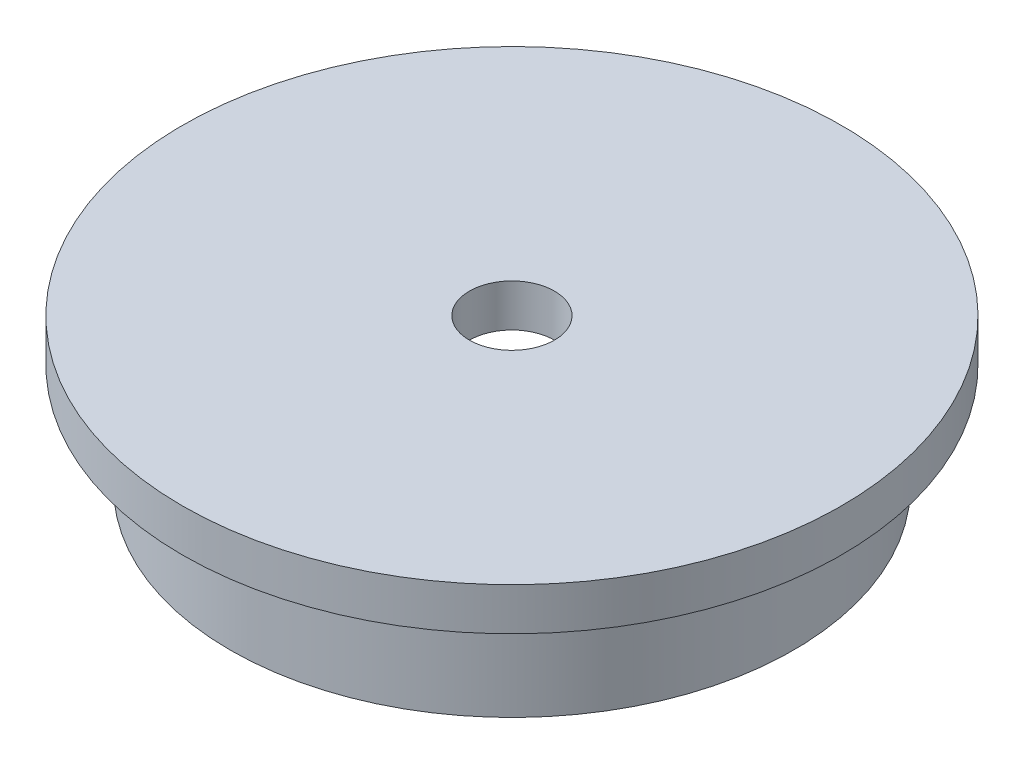
ISO-10303-21;
HEADER;
FILE_DESCRIPTION(('STEP AP214'),'2;1');
FILE_NAME('part.step','',(''),(''),'','','');
FILE_SCHEMA(('AUTOMOTIVE_DESIGN { 1 0 10303 214 1 1 1 1 }'));
ENDSEC;
DATA;
#1=APPLICATION_CONTEXT('core data for automotive mechanical design processes');
#2=APPLICATION_PROTOCOL_DEFINITION('international standard','automotive_design',2000,#1);
#3=PRODUCT_CONTEXT('',#1,'mechanical');
#4=PRODUCT('Part','Part','',(#3));
#5=PRODUCT_RELATED_PRODUCT_CATEGORY('part','',(#4));
#6=PRODUCT_DEFINITION_FORMATION('','',#4);
#7=PRODUCT_DEFINITION_CONTEXT('part definition',#1,'design');
#8=PRODUCT_DEFINITION('design','',#6,#7);
#9=PRODUCT_DEFINITION_SHAPE('','',#8);
#10=(LENGTH_UNIT() NAMED_UNIT(*) SI_UNIT(.MILLI.,.METRE.));
#11=(NAMED_UNIT(*) PLANE_ANGLE_UNIT() SI_UNIT($,.RADIAN.));
#12=(NAMED_UNIT(*) SI_UNIT($,.STERADIAN.) SOLID_ANGLE_UNIT());
#13=UNCERTAINTY_MEASURE_WITH_UNIT(LENGTH_MEASURE(1.E-05),#10,'distance_accuracy_value','');
#14=(GEOMETRIC_REPRESENTATION_CONTEXT(3) GLOBAL_UNCERTAINTY_ASSIGNED_CONTEXT((#13)) GLOBAL_UNIT_ASSIGNED_CONTEXT((#10,
#11,#12)) REPRESENTATION_CONTEXT('',''));
#15=CARTESIAN_POINT('',(0.,0.,0.));
#16=DIRECTION('',(0.,0.,1.));
#17=DIRECTION('',(1.,0.,0.));
#18=AXIS2_PLACEMENT_3D('',#15,#16,#17);
#19=CARTESIAN_POINT('',(0.,0.,0.));
#20=DIRECTION('',(0.,1.,0.));
#21=DIRECTION('',(0.,0.,1.));
#22=AXIS2_PLACEMENT_3D('',#19,#20,#21);
#23=PLANE('',#22);
#24=CARTESIAN_POINT('',(0.,0.,0.));
#25=DIRECTION('',(0.,1.,0.));
#26=DIRECTION('',(0.,0.,1.));
#27=AXIS2_PLACEMENT_3D('',#24,#25,#26);
#28=CIRCLE('',#27,33.655);
#29=CARTESIAN_POINT('',(0.,0.,33.655));
#30=VERTEX_POINT('',#29);
#31=EDGE_CURVE('E43',#30,#30,#28,.T.);
#32=ORIENTED_EDGE('',*,*,#31,.F.);
#33=EDGE_LOOP('',(#32));
#34=FACE_BOUND('',#33,.T.);
#35=CARTESIAN_POINT('',(0.,0.,0.));
#36=DIRECTION('',(0.,1.,0.));
#37=DIRECTION('',(0.,0.,1.));
#38=AXIS2_PLACEMENT_3D('',#35,#36,#37);
#39=CIRCLE('',#38,28.575);
#40=CARTESIAN_POINT('',(0.,0.,28.575));
#41=VERTEX_POINT('',#40);
#42=EDGE_CURVE('E48',#41,#41,#39,.T.);
#43=ORIENTED_EDGE('',*,*,#42,.T.);
#44=EDGE_LOOP('',(#43));
#45=FACE_BOUND('',#44,.T.);
#46=ADVANCED_FACE('F35',(#34,#45),#23,.F.);
#47=CARTESIAN_POINT('',(0.,12.7,0.));
#48=DIRECTION('',(0.,-1.,0.));
#49=DIRECTION('',(0.,0.,-1.));
#50=AXIS2_PLACEMENT_3D('',#47,#48,#49);
#51=CYLINDRICAL_SURFACE('',#50,33.655);
#52=CARTESIAN_POINT('',(0.,12.7,0.));
#53=DIRECTION('',(0.,1.,0.));
#54=DIRECTION('',(0.,0.,1.));
#55=AXIS2_PLACEMENT_3D('',#52,#53,#54);
#56=CIRCLE('',#55,33.655);
#57=CARTESIAN_POINT('',(0.,12.7,33.655));
#58=VERTEX_POINT('',#57);
#59=EDGE_CURVE('E10',#58,#58,#56,.T.);
#60=ORIENTED_EDGE('',*,*,#59,.F.);
#61=EDGE_LOOP('',(#60));
#62=FACE_BOUND('',#61,.T.);
#63=ORIENTED_EDGE('',*,*,#31,.T.);
#64=EDGE_LOOP('',(#63));
#65=FACE_BOUND('',#64,.T.);
#66=ADVANCED_FACE('F37',(#62,#65),#51,.T.);
#67=CARTESIAN_POINT('',(0.,12.7,0.));
#68=DIRECTION('',(0.,-1.,0.));
#69=DIRECTION('',(0.,0.,-1.));
#70=AXIS2_PLACEMENT_3D('',#67,#68,#69);
#71=CYLINDRICAL_SURFACE('',#70,28.575);
#72=CARTESIAN_POINT('',(0.,12.7,0.));
#73=DIRECTION('',(0.,1.,0.));
#74=DIRECTION('',(0.,0.,1.));
#75=AXIS2_PLACEMENT_3D('',#72,#73,#74);
#76=CIRCLE('',#75,28.575);
#77=CARTESIAN_POINT('',(0.,12.7,28.575));
#78=VERTEX_POINT('',#77);
#79=EDGE_CURVE('E52',#78,#78,#76,.T.);
#80=ORIENTED_EDGE('',*,*,#79,.T.);
#81=EDGE_LOOP('',(#80));
#82=FACE_BOUND('',#81,.T.);
#83=ORIENTED_EDGE('',*,*,#42,.F.);
#84=EDGE_LOOP('',(#83));
#85=FACE_BOUND('',#84,.T.);
#86=ADVANCED_FACE('F92',(#82,#85),#71,.F.);
#87=CARTESIAN_POINT('',(0.,12.7,0.));
#88=DIRECTION('',(0.,1.,0.));
#89=DIRECTION('',(0.,0.,1.));
#90=AXIS2_PLACEMENT_3D('',#87,#88,#89);
#91=PLANE('',#90);
#92=CARTESIAN_POINT('',(0.,12.7,0.));
#93=DIRECTION('',(0.,1.,0.));
#94=DIRECTION('',(0.,0.,1.));
#95=AXIS2_PLACEMENT_3D('',#92,#93,#94);
#96=CIRCLE('',#95,5.08);
#97=CARTESIAN_POINT('',(0.,12.7,5.08));
#98=VERTEX_POINT('',#97);
#99=EDGE_CURVE('E59',#98,#98,#96,.T.);
#100=ORIENTED_EDGE('',*,*,#99,.T.);
#101=EDGE_LOOP('',(#100));
#102=FACE_BOUND('',#101,.T.);
#103=ORIENTED_EDGE('',*,*,#79,.F.);
#104=EDGE_LOOP('',(#103));
#105=FACE_BOUND('',#104,.T.);
#106=ADVANCED_FACE('F81',(#102,#105),#91,.F.);
#107=CARTESIAN_POINT('',(0.,17.78,0.));
#108=DIRECTION('',(0.,-1.,0.));
#109=DIRECTION('',(0.,0.,-1.));
#110=AXIS2_PLACEMENT_3D('',#107,#108,#109);
#111=CYLINDRICAL_SURFACE('',#110,39.37);
#112=CARTESIAN_POINT('',(0.,17.78,0.));
#113=DIRECTION('',(0.,1.,0.));
#114=DIRECTION('',(0.,0.,1.));
#115=AXIS2_PLACEMENT_3D('',#112,#113,#114);
#116=CIRCLE('',#115,39.37);
#117=CARTESIAN_POINT('',(0.,17.78,39.37));
#118=VERTEX_POINT('',#117);
#119=EDGE_CURVE('E55',#118,#118,#116,.T.);
#120=ORIENTED_EDGE('',*,*,#119,.F.);
#121=EDGE_LOOP('',(#120));
#122=FACE_BOUND('',#121,.T.);
#123=CARTESIAN_POINT('',(0.,12.7,0.));
#124=DIRECTION('',(0.,1.,0.));
#125=DIRECTION('',(0.,0.,1.));
#126=AXIS2_PLACEMENT_3D('',#123,#124,#125);
#127=CIRCLE('',#126,39.37);
#128=CARTESIAN_POINT('',(0.,12.7,39.37));
#129=VERTEX_POINT('',#128);
#130=EDGE_CURVE('E56',#129,#129,#127,.T.);
#131=ORIENTED_EDGE('',*,*,#130,.T.);
#132=EDGE_LOOP('',(#131));
#133=FACE_BOUND('',#132,.T.);
#134=ADVANCED_FACE('F75',(#122,#133),#111,.T.);
#135=CARTESIAN_POINT('',(0.,17.78,0.));
#136=DIRECTION('',(0.,1.,0.));
#137=DIRECTION('',(0.,0.,1.));
#138=AXIS2_PLACEMENT_3D('',#135,#136,#137);
#139=PLANE('',#138);
#140=CARTESIAN_POINT('',(0.,17.78,0.));
#141=DIRECTION('',(0.,1.,0.));
#142=DIRECTION('',(0.,0.,1.));
#143=AXIS2_PLACEMENT_3D('',#140,#141,#142);
#144=CIRCLE('',#143,5.08);
#145=CARTESIAN_POINT('',(0.,17.78,5.08));
#146=VERTEX_POINT('',#145);
#147=EDGE_CURVE('E39',#146,#146,#144,.T.);
#148=ORIENTED_EDGE('',*,*,#147,.F.);
#149=EDGE_LOOP('',(#148));
#150=FACE_BOUND('',#149,.T.);
#151=ORIENTED_EDGE('',*,*,#119,.T.);
#152=EDGE_LOOP('',(#151));
#153=FACE_BOUND('',#152,.T.);
#154=ADVANCED_FACE('F71',(#150,#153),#139,.T.);
#155=ORIENTED_EDGE('',*,*,#59,.T.);
#156=EDGE_LOOP('',(#155));
#157=FACE_BOUND('',#156,.T.);
#158=ORIENTED_EDGE('',*,*,#130,.F.);
#159=EDGE_LOOP('',(#158));
#160=FACE_BOUND('',#159,.T.);
#161=ADVANCED_FACE('F74',(#157,#160),#91,.F.);
#162=CARTESIAN_POINT('',(0.,0.,0.));
#163=DIRECTION('',(0.,1.,0.));
#164=DIRECTION('',(0.,0.,1.));
#165=AXIS2_PLACEMENT_3D('',#162,#163,#164);
#166=CYLINDRICAL_SURFACE('',#165,5.08);
#167=ORIENTED_EDGE('',*,*,#147,.T.);
#168=EDGE_LOOP('',(#167));
#169=FACE_BOUND('',#168,.T.);
#170=ORIENTED_EDGE('',*,*,#99,.F.);
#171=EDGE_LOOP('',(#170));
#172=FACE_BOUND('',#171,.T.);
#173=ADVANCED_FACE('F68',(#169,#172),#166,.F.);
#174=CLOSED_SHELL('',(#46,#66,#86,#106,#134,#154,#161,#173));
#175=MANIFOLD_SOLID_BREP('B2',#174);
#176=ADVANCED_BREP_SHAPE_REPRESENTATION('',(#18,#175),#14);
#177=SHAPE_DEFINITION_REPRESENTATION(#9,#176);
ENDSEC;
END-ISO-10303-21;
